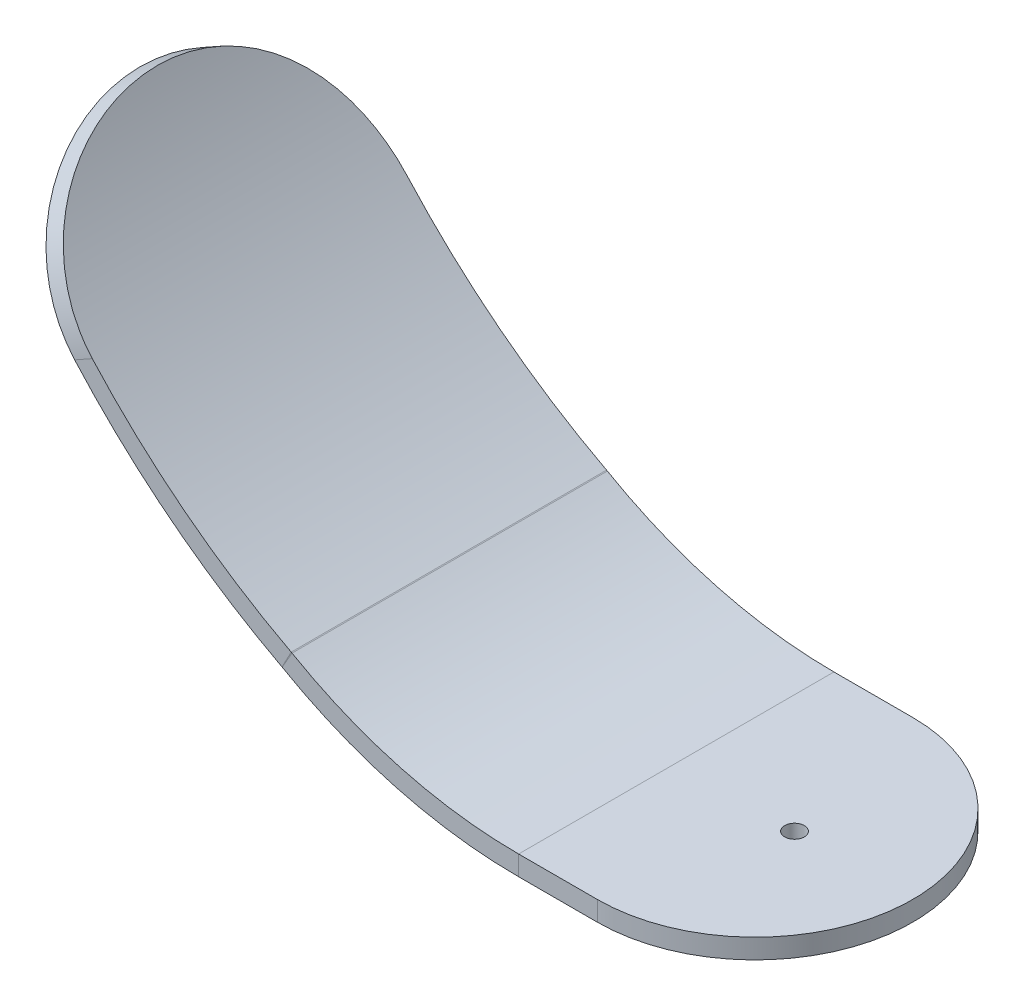
ISO-10303-21;
HEADER;
FILE_DESCRIPTION(('STEP AP214'),'2;1');
FILE_NAME('part.step','',(''),(''),'','','');
FILE_SCHEMA(('AUTOMOTIVE_DESIGN { 1 0 10303 214 1 1 1 1 }'));
ENDSEC;
DATA;
#1=APPLICATION_CONTEXT('core data for automotive mechanical design processes');
#2=APPLICATION_PROTOCOL_DEFINITION('international standard','automotive_design',2000,#1);
#3=PRODUCT_CONTEXT('',#1,'mechanical');
#4=PRODUCT('Part','Part','',(#3));
#5=PRODUCT_RELATED_PRODUCT_CATEGORY('part','',(#4));
#6=PRODUCT_DEFINITION_FORMATION('','',#4);
#7=PRODUCT_DEFINITION_CONTEXT('part definition',#1,'design');
#8=PRODUCT_DEFINITION('design','',#6,#7);
#9=PRODUCT_DEFINITION_SHAPE('','',#8);
#10=(LENGTH_UNIT() NAMED_UNIT(*) SI_UNIT(.MILLI.,.METRE.));
#11=(NAMED_UNIT(*) PLANE_ANGLE_UNIT() SI_UNIT($,.RADIAN.));
#12=(NAMED_UNIT(*) SI_UNIT($,.STERADIAN.) SOLID_ANGLE_UNIT());
#13=UNCERTAINTY_MEASURE_WITH_UNIT(LENGTH_MEASURE(1.E-05),#10,'distance_accuracy_value','');
#14=(GEOMETRIC_REPRESENTATION_CONTEXT(3) GLOBAL_UNCERTAINTY_ASSIGNED_CONTEXT((#13)) GLOBAL_UNIT_ASSIGNED_CONTEXT((#10,
#11,#12)) REPRESENTATION_CONTEXT('',''));
#15=CARTESIAN_POINT('',(0.,0.,0.));
#16=DIRECTION('',(0.,0.,1.));
#17=DIRECTION('',(1.,0.,0.));
#18=AXIS2_PLACEMENT_3D('',#15,#16,#17);
#19=CARTESIAN_POINT('',(-25.4,0.,25.4));
#20=DIRECTION('',(0.,-1.,0.));
#21=DIRECTION('',(1.,0.,0.));
#22=AXIS2_PLACEMENT_3D('',#19,#20,#21);
#23=CYLINDRICAL_SURFACE('',#22,25.4);
#24=DIRECTION('',(0.,-1.,0.));
#25=VECTOR('',#24,1.);
#26=CARTESIAN_POINT('',(-25.4,115.402982206025,50.8));
#27=LINE('',#26,#25);
#28=CARTESIAN_POINT('',(-25.4,0.,50.8));
#29=VERTEX_POINT('',#28);
#30=CARTESIAN_POINT('',(-25.4,3.175,50.8));
#31=VERTEX_POINT('',#30);
#32=EDGE_CURVE('E263',#29,#31,#27,.F.);
#33=ORIENTED_EDGE('',*,*,#32,.F.);
#34=CARTESIAN_POINT('',(-25.4,0.,25.4));
#35=DIRECTION('',(0.,-1.,0.));
#36=DIRECTION('',(1.,0.,0.));
#37=AXIS2_PLACEMENT_3D('',#34,#35,#36);
#38=CIRCLE('',#37,25.4);
#39=CARTESIAN_POINT('',(-25.4,0.,0.));
#40=VERTEX_POINT('',#39);
#41=EDGE_CURVE('E47',#40,#29,#38,.T.);
#42=ORIENTED_EDGE('',*,*,#41,.F.);
#43=DIRECTION('',(0.,-1.,0.));
#44=VECTOR('',#43,1.);
#45=CARTESIAN_POINT('',(-25.4,13.0250291489278,0.));
#46=LINE('',#45,#44);
#47=CARTESIAN_POINT('',(-25.4,3.175,0.));
#48=VERTEX_POINT('',#47);
#49=EDGE_CURVE('E266',#48,#40,#46,.T.);
#50=ORIENTED_EDGE('',*,*,#49,.F.);
#51=CARTESIAN_POINT('',(-25.4,3.175,25.4));
#52=DIRECTION('',(0.,-1.,0.));
#53=DIRECTION('',(1.,0.,0.));
#54=AXIS2_PLACEMENT_3D('',#51,#52,#53);
#55=CIRCLE('',#54,25.4);
#56=EDGE_CURVE('E11',#31,#48,#55,.F.);
#57=ORIENTED_EDGE('',*,*,#56,.F.);
#58=EDGE_LOOP('',(#33,#42,#50,#57));
#59=FACE_BOUND('',#58,.T.);
#60=ADVANCED_FACE('F39',(#59),#23,.T.);
#61=CARTESIAN_POINT('',(-106.784722598422,37.9480346007612,25.4));
#62=DIRECTION('',(0.87169546734506,0.490047969294923,0.));
#63=DIRECTION('',(-0.490047969294923,0.87169546734506,0.));
#64=AXIS2_PLACEMENT_3D('',#61,#62,#63);
#65=CYLINDRICAL_SURFACE('',#64,25.4000000000003);
#66=DIRECTION('',(0.87169546734506,0.490047969294923,0.));
#67=VECTOR('',#66,1.);
#68=CARTESIAN_POINT('',(-93.0073183432006,45.6933874566041,50.8));
#69=LINE('',#68,#67);
#70=CARTESIAN_POINT('',(-106.784722598422,37.9480346007612,50.8));
#71=VERTEX_POINT('',#70);
#72=CARTESIAN_POINT('',(-109.619648197066,36.3543019443849,50.8));
#73=VERTEX_POINT('',#72);
#74=EDGE_CURVE('E146',#71,#73,#69,.F.);
#75=ORIENTED_EDGE('',*,*,#74,.F.);
#76=CARTESIAN_POINT('',(-106.784722598422,37.9480346007612,0.));
#77=CARTESIAN_POINT('',(-107.023325601551,38.2127882243219,3.30865011441573E-07));
#78=CARTESIAN_POINT('',(-107.260675530576,38.4786182917818,0.00714117887424488));
#79=CARTESIAN_POINT('',(-107.732536388339,39.0120287740208,0.0357754976010913));
#80=CARTESIAN_POINT('',(-107.967047256145,39.2796092261776,0.0572692758084516));
#81=CARTESIAN_POINT('',(-108.665750928703,40.0842909912057,0.143380062575102));
#82=CARTESIAN_POINT('',(-109.125172099691,40.6233963054945,0.229626489559083));
#83=CARTESIAN_POINT('',(-110.02788218582,41.7023744570321,0.459814883355029));
#84=CARTESIAN_POINT('',(-110.471176556576,42.2422469692981,0.60373713697935));
#85=CARTESIAN_POINT('',(-111.339119219691,43.3186572998939,0.948841399319553));
#86=CARTESIAN_POINT('',(-111.763768644082,43.8551953189753,1.15001992614539));
#87=CARTESIAN_POINT('',(-112.592506415038,44.9210974957197,1.60897857426348));
#88=CARTESIAN_POINT('',(-112.996568009149,45.4504516949598,1.86683013836865));
#89=CARTESIAN_POINT('',(-113.781424373004,46.4966616478754,2.4375084979489));
#90=CARTESIAN_POINT('',(-114.162218499472,47.0135170557581,2.75033681244138));
#91=CARTESIAN_POINT('',(-114.898537515845,48.0297945282585,3.42879298796404));
#92=CARTESIAN_POINT('',(-115.254074733404,48.5292250363796,3.79439482284478));
#93=CARTESIAN_POINT('',(-115.938615586909,49.50631996806,4.57602489001189));
#94=CARTESIAN_POINT('',(-116.26761967713,49.9839847642107,4.99205225865415));
#95=CARTESIAN_POINT('',(-116.894019674781,50.9072982058846,5.86611413775237));
#96=CARTESIAN_POINT('',(-117.191759072911,51.3532722424196,6.32355901334728));
#97=CARTESIAN_POINT('',(-117.759447388803,52.2155825876365,7.28158744410139));
#98=CARTESIAN_POINT('',(-118.029396384675,52.631918979621,7.78217087800213));
#99=CARTESIAN_POINT('',(-118.5410600844,53.4313098109132,8.82320649495364));
#100=CARTESIAN_POINT('',(-118.782761666191,53.8143487612183,9.363677018466));
#101=CARTESIAN_POINT('',(-119.237430279372,54.5433895512321,10.4804831304676));
#102=CARTESIAN_POINT('',(-119.450397473687,54.8893916009396,11.0568185155742));
#103=CARTESIAN_POINT('',(-119.84848873594,55.5429298181129,12.2445422003344));
#104=CARTESIAN_POINT('',(-120.033455172619,55.8502466847024,12.8561040004677));
#105=CARTESIAN_POINT('',(-120.374088607986,56.4213318392348,14.1071285531171));
#106=CARTESIAN_POINT('',(-120.529754041975,56.6850978014307,14.7465927934019));
#107=CARTESIAN_POINT('',(-120.811652624602,57.166348540325,16.048271908731));
#108=CARTESIAN_POINT('',(-120.937912999544,57.3838761129752,16.7104650817196));
#109=CARTESIAN_POINT('',(-121.161229981467,57.7708748190289,18.0534636162973));
#110=CARTESIAN_POINT('',(-121.258292401379,57.9403555175503,18.7342652437055));
#111=CARTESIAN_POINT('',(-121.399430699345,58.187830218272,19.9106795545831));
#112=CARTESIAN_POINT('',(-121.450712120316,58.2781069823503,20.4028963558551));
#113=CARTESIAN_POINT('',(-121.538613225629,58.4331996769902,21.3927169764286));
#114=CARTESIAN_POINT('',(-121.575230918439,58.4980121491337,21.8903215180391));
#115=CARTESIAN_POINT('',(-121.633810382664,58.6018365529991,22.8890896378454));
#116=CARTESIAN_POINT('',(-121.655771655947,58.640847607799,23.3902533364224));
#117=CARTESIAN_POINT('',(-121.685049220584,58.6928802693916,24.3942604051255));
#118=CARTESIAN_POINT('',(-121.692367476007,58.7059053616795,24.8971035409246));
#119=CARTESIAN_POINT('',(-121.692366061648,58.7058979633249,26.1133183594673));
#120=CARTESIAN_POINT('',(-121.677640346954,58.6796820895864,26.826744000839));
#121=CARTESIAN_POINT('',(-121.618711507486,58.5750523055059,28.2486227830917));
#122=CARTESIAN_POINT('',(-121.574502307595,58.4966276374653,28.9570748687556));
#123=CARTESIAN_POINT('',(-121.456500422935,58.2882463230997,30.3645067201338));
#124=CARTESIAN_POINT('',(-121.382682359954,58.158245471078,31.0634778268719));
#125=CARTESIAN_POINT('',(-121.205395131838,57.8479798639155,32.4462988861666));
#126=CARTESIAN_POINT('',(-121.101927499142,57.6677177065452,33.1301496182531));
#127=CARTESIAN_POINT('',(-120.865299668034,57.2587283113785,34.4777051307567));
#128=CARTESIAN_POINT('',(-120.732148289986,57.0300154714419,35.1414158292538));
#129=CARTESIAN_POINT('',(-120.436080523831,56.5262866765252,36.444181079214));
#130=CARTESIAN_POINT('',(-120.273163748624,56.2512701193676,37.0832353098882));
#131=CARTESIAN_POINT('',(-119.917595171532,55.6576125458774,38.3320169658976));
#132=CARTESIAN_POINT('',(-119.724947907837,55.338978188389,38.941748848521));
#133=CARTESIAN_POINT('',(-119.309996272135,54.6610910418912,40.1276154322085));
#134=CARTESIAN_POINT('',(-119.087692084198,54.3018385049853,40.7037503417642));
#135=CARTESIAN_POINT('',(-118.61412275359,53.5468675173285,41.8171884689482));
#136=CARTESIAN_POINT('',(-118.362915211663,53.1512218986343,42.3545655629029));
#137=CARTESIAN_POINT('',(-117.831601654033,52.326600751898,43.3878710279075));
#138=CARTESIAN_POINT('',(-117.551495566226,51.8976251406978,43.8837992955363));
#139=CARTESIAN_POINT('',(-116.963059661177,51.0104271164967,44.8305971984173));
#140=CARTESIAN_POINT('',(-116.65473292408,50.5522078969411,45.2814717398536));
#141=CARTESIAN_POINT('',(-116.0107475153,49.6107726167076,46.1350119629347));
#142=CARTESIAN_POINT('',(-115.675089407283,49.1275570716126,46.5376786383643));
#143=CARTESIAN_POINT('',(-114.980523857103,48.1446585225039,47.2889092967448));
#144=CARTESIAN_POINT('',(-114.621830032719,47.6451433854686,47.637890512962));
#145=CARTESIAN_POINT('',(-113.880241122737,46.6303857118902,48.2834050863107));
#146=CARTESIAN_POINT('',(-113.497344940675,46.1151424633481,48.5799360649206));
#147=CARTESIAN_POINT('',(-112.70926278618,45.0735638299626,49.1186701265746));
#148=CARTESIAN_POINT('',(-112.304079516041,44.5472297946231,49.360879778042));
#149=CARTESIAN_POINT('',(-111.473572918818,43.4879585973653,49.7896631798453));
#150=CARTESIAN_POINT('',(-111.048253698924,42.9550227982637,49.976248219928));
#151=CARTESIAN_POINT('',(-110.309589264829,42.0463945082449,50.2457281786717));
#152=CARTESIAN_POINT('',(-110.000711405726,41.6712446559402,50.3429497392153));
#153=CARTESIAN_POINT('',(-109.375200146736,40.9213068757451,50.509522928987));
#154=CARTESIAN_POINT('',(-109.058568145678,40.5465188950705,50.5788795462586));
#155=CARTESIAN_POINT('',(-108.419025463186,39.7992839563848,50.689621993426));
#156=CARTESIAN_POINT('',(-108.096126147414,39.4268341345264,50.7310543305587));
#157=CARTESIAN_POINT('',(-107.444516259768,38.6848848763692,50.7862538113699));
#158=CARTESIAN_POINT('',(-107.115804877149,38.3153858622927,50.800017064183));
#159=CARTESIAN_POINT('',(-106.784722598422,37.9480346007613,50.8000000000003));
#160=B_SPLINE_CURVE_WITH_KNOTS('',3,(#76,#77,#78,#79,#80,#81,#82,#83,#84,#85,#86,#87,#88,#89,
#90,#91,#92,#93,#94,#95,#96,#97,#98,#99,#100,#101,#102,#103,#104,#105,#106,#107,#108,#109,#110,
#111,#112,#113,#114,#115,#116,#117,#118,#119,#120,#121,#122,#123,#124,#125,#126,#127,#128,#129,
#130,#131,#132,#133,#134,#135,#136,#137,#138,#139,#140,#141,#142,#143,#144,#145,#146,#147,#148,
#149,#150,#151,#152,#153,#154,#155,#156,#157,#158,#159),.UNSPECIFIED.,.F.,.F.,(4,2,2,2,2,2,2,2,
2,2,2,2,2,2,2,2,2,2,2,2,2,2,2,2,2,2,2,2,2,2,2,2,2,2,2,2,2,2,2,2,2,4),(0.,1.06906494698775,
2.13815279780436,4.2760725035595,6.41326210593933,8.55032176850064,10.6900910493909,
12.8299194617857,14.9686961645655,17.1074362414376,19.2194607875017,21.3314793970558,
23.4444752570183,25.5574591356887,27.6819279911379,29.8065102628412,31.9291174812651,
34.0513018362107,35.5596226716561,37.0681482880631,38.5767251726269,40.0850996982768,
42.2246081849275,44.3645576569483,46.5063452454546,48.6480221555533,50.7890635242088,
52.9301327391432,55.070875454815,57.2116048843368,59.3481396846592,61.4846798158009,
63.6209870314932,65.7572502005211,67.8759660324053,69.9947779195228,72.113333465957,
74.2314587304616,75.7174027563744,77.2030806680041,78.6862780625312,80.1696840117706),.UNSPECIFIED.);
#161=CARTESIAN_POINT('',(-106.784722598422,37.9480346007612,0.));
#162=VERTEX_POINT('',#161);
#163=EDGE_CURVE('E211',#162,#71,#160,.T.);
#164=ORIENTED_EDGE('',*,*,#163,.F.);
#165=DIRECTION('',(-0.87169546734506,-0.490047969294923,0.));
#166=VECTOR('',#165,1.);
#167=CARTESIAN_POINT('',(-106.784722598422,37.9480346007612,0.));
#168=LINE('',#167,#166);
#169=CARTESIAN_POINT('',(-109.619648197066,36.3543019443849,0.));
#170=VERTEX_POINT('',#169);
#171=EDGE_CURVE('E208',#170,#162,#168,.F.);
#172=ORIENTED_EDGE('',*,*,#171,.F.);
#173=CARTESIAN_POINT('',(-109.619648197066,36.3543019443849,50.8));
#174=CARTESIAN_POINT('',(-109.856684647917,36.6205153726169,50.7999996691407));
#175=CARTESIAN_POINT('',(-110.092494087076,36.8877684792837,50.7928380754912));
#176=CARTESIAN_POINT('',(-110.561327225008,37.4239487970942,50.7641254129413));
#177=CARTESIAN_POINT('',(-110.794350867339,37.692876041989,50.7425740530024));
#178=CARTESIAN_POINT('',(-111.48867223753,38.501476202545,50.6562426571512));
#179=CARTESIAN_POINT('',(-111.945280948255,39.0430355524584,50.5697853386797));
#180=CARTESIAN_POINT('',(-112.842594159045,40.1265838125329,50.3390861433986));
#181=CARTESIAN_POINT('',(-113.283304337101,40.6685724972526,50.1948651235117));
#182=CARTESIAN_POINT('',(-114.146328525858,41.7488916295281,49.8491069199071));
#183=CARTESIAN_POINT('',(-114.56864360809,42.2872222886212,49.6475730798761));
#184=CARTESIAN_POINT('',(-115.392951103006,43.3563766146426,49.1878841304094));
#185=CARTESIAN_POINT('',(-115.794917933489,43.887190255688,48.9296598225549));
#186=CARTESIAN_POINT('',(-116.575848686518,44.9360251238294,48.3582335520248));
#187=CARTESIAN_POINT('',(-116.954811993085,45.4540460081458,48.0450301180119));
#188=CARTESIAN_POINT('',(-117.687736860527,46.4723930283072,47.3658316346703));
#189=CARTESIAN_POINT('',(-118.041710293389,46.9727275092857,46.9998619079746));
#190=CARTESIAN_POINT('',(-118.72337484245,47.9513918040916,46.217515886895));
#191=CARTESIAN_POINT('',(-119.051066392835,48.4297219813833,45.8011404255197));
#192=CARTESIAN_POINT('',(-119.675292639808,49.3544499919483,44.9261277693685));
#193=CARTESIAN_POINT('',(-119.972150490264,49.8011590203259,44.4680497564059));
#194=CARTESIAN_POINT('',(-120.538245995256,50.6647234797638,43.5087262951302));
#195=CARTESIAN_POINT('',(-120.8074837156,51.0815789819529,43.0074809496735));
#196=CARTESIAN_POINT('',(-121.317866686622,51.8818110043325,41.9651016526541));
#197=CARTESIAN_POINT('',(-121.558998990148,52.2651720746426,41.4239495034085));
#198=CARTESIAN_POINT('',(-122.01264296502,52.9946805698633,40.3057663189756));
#199=CARTESIAN_POINT('',(-122.225154811875,53.3408282229741,39.7287355038379));
#200=CARTESIAN_POINT('',(-122.622368428721,53.9944196640047,38.5397566199285));
#201=CARTESIAN_POINT('',(-122.806920131854,54.3016532432744,37.9276428655535));
#202=CARTESIAN_POINT('',(-123.14679346357,54.8724508035747,36.6755295085244));
#203=CARTESIAN_POINT('',(-123.302113519534,55.1360124350304,36.0355284078539));
#204=CARTESIAN_POINT('',(-123.58336223321,55.6167489427627,34.7328034938892));
#205=CARTESIAN_POINT('',(-123.709318308018,55.8339670736699,34.0701015449581));
#206=CARTESIAN_POINT('',(-123.93204451221,56.2202592129703,32.7261159969562));
#207=CARTESIAN_POINT('',(-124.028820514354,56.3893429084813,32.0448361669935));
#208=CARTESIAN_POINT('',(-124.169228195288,56.6356556032368,30.8696401087896));
#209=CARTESIAN_POINT('',(-124.220125929756,56.7252882422794,30.3791382510331));
#210=CARTESIAN_POINT('',(-124.307373329242,56.8792696844455,29.3928062051459));
#211=CARTESIAN_POINT('',(-124.34372105105,56.9436151103465,28.896975314377));
#212=CARTESIAN_POINT('',(-124.4018672161,57.0466841396899,27.9018451848182));
#213=CARTESIAN_POINT('',(-124.423666687349,57.0854095534913,27.4025461936108));
#214=CARTESIAN_POINT('',(-124.452733935091,57.1370699874016,26.4021826860786));
#215=CARTESIAN_POINT('',(-124.460000608451,57.150003049705,25.9011180386208));
#216=CARTESIAN_POINT('',(-124.459999133882,57.14999565881,24.6866694098299));
#217=CARTESIAN_POINT('',(-124.445272646507,57.1237790018005,23.9732306336741));
#218=CARTESIAN_POINT('',(-124.386343846258,57.0191441635877,22.55132504788));
#219=CARTESIAN_POINT('',(-124.342135405224,56.9407151294526,21.8428593028881));
#220=CARTESIAN_POINT('',(-124.224145879068,56.7323153156231,20.4353953050146));
#221=CARTESIAN_POINT('',(-124.150339204502,56.6022999374814,19.7364057869001));
#222=CARTESIAN_POINT('',(-123.97310145946,56.2919867857572,18.3535493228887));
#223=CARTESIAN_POINT('',(-123.869671934092,56.1116916347486,17.6696815902526));
#224=CARTESIAN_POINT('',(-123.633169068041,55.7026070769076,16.3220974978328));
#225=CARTESIAN_POINT('',(-123.500104722366,55.4738323860118,15.6583750926843));
#226=CARTESIAN_POINT('',(-123.204285313838,54.9699350497098,14.3555868199373));
#227=CARTESIAN_POINT('',(-123.041529862391,54.6948117977048,13.7165212751763));
#228=CARTESIAN_POINT('',(-122.686388221924,54.1008792187893,12.4677183628427));
#229=CARTESIAN_POINT('',(-122.494006650694,53.78207670097,11.857976444033));
#230=CARTESIAN_POINT('',(-122.079721855982,53.1037704255811,10.6720870261377));
#231=CARTESIAN_POINT('',(-121.857818812851,52.7442669166629,10.0959393218503));
#232=CARTESIAN_POINT('',(-121.385193148976,51.9886483434294,8.9824110273131));
#233=CARTESIAN_POINT('',(-121.134524694935,51.5926023574062,8.44496057727446));
#234=CARTESIAN_POINT('',(-120.604480687118,50.7670425951542,7.41150957726689));
#235=CARTESIAN_POINT('',(-120.325105058743,50.3375287319566,6.91550913501593));
#236=CARTESIAN_POINT('',(-119.738346192798,49.4490855143951,5.96856228444157));
#237=CARTESIAN_POINT('',(-119.430965733446,48.9901590792409,5.5176114162619));
#238=CARTESIAN_POINT('',(-118.78911447152,48.0471166407457,4.66392005562827));
#239=CARTESIAN_POINT('',(-118.454644219532,47.5630011494311,4.26117858375459));
#240=CARTESIAN_POINT('',(-117.762550199406,46.577873781998,3.50963906296199));
#241=CARTESIAN_POINT('',(-117.405126718158,46.0770225828801,3.16044586689158));
#242=CARTESIAN_POINT('',(-116.666322471476,45.0593369513628,2.51456738523274));
#243=CARTESIAN_POINT('',(-116.284940601445,44.5425017825835,2.21788452303622));
#244=CARTESIAN_POINT('',(-115.500143276246,43.4974757455859,1.67892676796323));
#245=CARTESIAN_POINT('',(-115.096730844263,42.9692864414618,1.43664443308165));
#246=CARTESIAN_POINT('',(-114.270017181863,41.9060221146853,1.00781045174917));
#247=CARTESIAN_POINT('',(-113.846720044972,41.3709485255782,0.821247392444506));
#248=CARTESIAN_POINT('',(-113.112738378635,40.4597212632424,0.552285066263908));
#249=CARTESIAN_POINT('',(-112.806487466623,40.0841866492688,0.455434090584687));
#250=CARTESIAN_POINT('',(-112.186398274675,39.3333342265346,0.289480817779988));
#251=CARTESIAN_POINT('',(-111.872561378298,38.9580163908329,0.220373500550059));
#252=CARTESIAN_POINT('',(-111.238756368639,38.2095633680984,0.110018310806868));
#253=CARTESIAN_POINT('',(-110.918799303701,37.8364255913487,0.0687243600345234));
#254=CARTESIAN_POINT('',(-110.273213844784,37.092937491274,0.0137047792041568));
#255=CARTESIAN_POINT('',(-109.947584635907,36.7225875796025,-1.68561260407032E-05));
#256=CARTESIAN_POINT('',(-109.619648197066,36.3543019443849,-3.22031762151008E-13));
#257=B_SPLINE_CURVE_WITH_KNOTS('',3,(#173,#174,#175,#176,#177,#178,#179,#180,#181,#182,#183,
#184,#185,#186,#187,#188,#189,#190,#191,#192,#193,#194,#195,#196,#197,#198,#199,#200,#201,#202,
#203,#204,#205,#206,#207,#208,#209,#210,#211,#212,#213,#214,#215,#216,#217,#218,#219,#220,#221,
#222,#223,#224,#225,#226,#227,#228,#229,#230,#231,#232,#233,#234,#235,#236,#237,#238,#239,#240,
#241,#242,#243,#244,#245,#246,#247,#248,#249,#250,#251,#252,#253,#254,#255,#256),.UNSPECIFIED.,
.F.,.F.,(4,2,2,2,2,2,2,2,2,2,2,2,2,2,2,2,2,2,2,2,2,2,2,2,2,2,2,2,2,2,2,2,2,2,2,2,2,2,2,2,2,4),
(0.,1.06919065125569,2.13840292795149,4.27655518016874,6.41393609796215,8.55119234440878,
10.6910720528244,12.8310090368801,14.9699224587796,17.1088005376711,19.2223365306501,
21.3358674877705,23.4503682562509,25.5648560574396,27.6903186363122,29.8158955291351,
31.9394797541279,34.0626363024083,35.565469260701,37.0685028610339,38.5714302427942,
40.0744717020655,42.2140184127416,44.3540099912674,46.4958557230943,48.6375897579532,
50.7786745995611,52.9197874653506,55.0605669354304,57.2013333277227,59.3381327283815,
61.4749376818625,63.6115308840255,65.748080671896,67.8680150654028,69.9880472700005,
72.1077892767483,74.227096803273,75.7088078161505,77.19025059835,78.6692330052552,
80.1484296744091),.UNSPECIFIED.);
#258=EDGE_CURVE('E218',#73,#170,#257,.T.);
#259=ORIENTED_EDGE('',*,*,#258,.F.);
#260=EDGE_LOOP('',(#75,#164,#172,#259));
#261=FACE_BOUND('',#260,.T.);
#262=ADVANCED_FACE('F226',(#261),#65,.T.);
#263=CARTESIAN_POINT('',(-38.1,3.175,50.8));
#264=DIRECTION('',(0.,0.,1.));
#265=DIRECTION('',(1.,0.,0.));
#266=AXIS2_PLACEMENT_3D('',#263,#264,#265);
#267=PLANE('',#266);
#268=DIRECTION('',(0.,-1.,0.));
#269=VECTOR('',#268,1.);
#270=CARTESIAN_POINT('',(-38.1,3.175,50.8));
#271=LINE('',#270,#269);
#272=CARTESIAN_POINT('',(-38.1,3.175,50.8));
#273=VERTEX_POINT('',#272);
#274=CARTESIAN_POINT('',(-38.1,0.,50.8));
#275=VERTEX_POINT('',#274);
#276=EDGE_CURVE('E204',#273,#275,#271,.T.);
#277=ORIENTED_EDGE('',*,*,#276,.F.);
#278=CARTESIAN_POINT('',(-38.1,76.2,50.8));
#279=DIRECTION('',(0.,0.,1.));
#280=DIRECTION('',(1.,0.,0.));
#281=AXIS2_PLACEMENT_3D('',#278,#279,#280);
#282=CIRCLE('',#281,73.025);
#283=CARTESIAN_POINT('',(-74.6006325917478,12.9516447217619,50.8));
#284=VERTEX_POINT('',#283);
#285=EDGE_CURVE('E161',#273,#284,#282,.F.);
#286=ORIENTED_EDGE('',*,*,#285,.T.);
#287=DIRECTION('',(-0.499837488418323,-0.86611920956163,0.));
#288=VECTOR('',#287,1.);
#289=CARTESIAN_POINT('',(-74.6006325917478,12.9516447217619,50.8));
#290=LINE('',#289,#288);
#291=CARTESIAN_POINT('',(-76.187616617476,10.2017162314037,50.8));
#292=VERTEX_POINT('',#291);
#293=EDGE_CURVE('E126',#284,#292,#290,.T.);
#294=ORIENTED_EDGE('',*,*,#293,.T.);
#295=CARTESIAN_POINT('',(-38.1,76.2,50.8));
#296=DIRECTION('',(0.,0.,-1.));
#297=DIRECTION('',(-1.,0.,0.));
#298=AXIS2_PLACEMENT_3D('',#295,#296,#297);
#299=CIRCLE('',#298,76.2);
#300=EDGE_CURVE('E152',#275,#292,#299,.T.);
#301=ORIENTED_EDGE('',*,*,#300,.F.);
#302=EDGE_LOOP('',(#277,#286,#294,#301));
#303=FACE_BOUND('',#302,.T.);
#304=ADVANCED_FACE('F250',(#303),#267,.T.);
#305=CARTESIAN_POINT('',(-38.1,0.,0.));
#306=DIRECTION('',(0.,0.,-1.));
#307=DIRECTION('',(-1.,0.,0.));
#308=AXIS2_PLACEMENT_3D('',#305,#306,#307);
#309=PLANE('',#308);
#310=DIRECTION('',(0.,1.,0.));
#311=VECTOR('',#310,1.);
#312=CARTESIAN_POINT('',(-38.1,0.,0.));
#313=LINE('',#312,#311);
#314=CARTESIAN_POINT('',(-38.1,0.,0.));
#315=VERTEX_POINT('',#314);
#316=CARTESIAN_POINT('',(-38.1,3.175,0.));
#317=VERTEX_POINT('',#316);
#318=EDGE_CURVE('E125',#315,#317,#313,.T.);
#319=ORIENTED_EDGE('',*,*,#318,.F.);
#320=CARTESIAN_POINT('',(-38.1,76.2,0.));
#321=DIRECTION('',(0.,0.,-1.));
#322=DIRECTION('',(-1.,0.,0.));
#323=AXIS2_PLACEMENT_3D('',#320,#321,#322);
#324=CIRCLE('',#323,76.2);
#325=CARTESIAN_POINT('',(-76.187616617476,10.2017162314037,0.));
#326=VERTEX_POINT('',#325);
#327=EDGE_CURVE('E173',#315,#326,#324,.T.);
#328=ORIENTED_EDGE('',*,*,#327,.T.);
#329=DIRECTION('',(0.499837488418323,0.86611920956163,0.));
#330=VECTOR('',#329,1.);
#331=CARTESIAN_POINT('',(-76.187616617476,10.2017162314037,0.));
#332=LINE('',#331,#330);
#333=CARTESIAN_POINT('',(-74.6006325917478,12.9516447217619,0.));
#334=VERTEX_POINT('',#333);
#335=EDGE_CURVE('E199',#326,#334,#332,.T.);
#336=ORIENTED_EDGE('',*,*,#335,.T.);
#337=CARTESIAN_POINT('',(-38.1,76.2,0.));
#338=DIRECTION('',(0.,0.,1.));
#339=DIRECTION('',(1.,0.,0.));
#340=AXIS2_PLACEMENT_3D('',#337,#338,#339);
#341=CIRCLE('',#340,73.025);
#342=EDGE_CURVE('E180',#317,#334,#341,.F.);
#343=ORIENTED_EDGE('',*,*,#342,.F.);
#344=EDGE_LOOP('',(#319,#328,#336,#343));
#345=FACE_BOUND('',#344,.T.);
#346=ADVANCED_FACE('F248',(#345),#309,.T.);
#347=CARTESIAN_POINT('',(-76.2126745001761,10.2155353767791,50.8));
#348=DIRECTION('',(0.,0.,1.));
#349=DIRECTION('',(1.,0.,0.));
#350=AXIS2_PLACEMENT_3D('',#347,#348,#349);
#351=PLANE('',#350);
#352=DIRECTION('',(0.465819184453999,0.884879928235809,0.));
#353=VECTOR('',#352,1.);
#354=CARTESIAN_POINT('',(-76.2126745001761,10.2155353767791,50.8));
#355=LINE('',#354,#353);
#356=CARTESIAN_POINT('',(-76.2126745001761,10.2155353767791,50.8));
#357=VERTEX_POINT('',#356);
#358=CARTESIAN_POINT('',(-74.7336985895347,13.0250291489278,50.8));
#359=VERTEX_POINT('',#358);
#360=EDGE_CURVE('E113',#357,#359,#355,.T.);
#361=ORIENTED_EDGE('',*,*,#360,.F.);
#362=CARTESIAN_POINT('',(-76.555796911445,9.56373282164059,50.8));
#363=DIRECTION('',(0.,0.,-1.));
#364=DIRECTION('',(-1.,0.,0.));
#365=AXIS2_PLACEMENT_3D('',#362,#363,#364);
#366=CIRCLE('',#365,0.7366);
#367=EDGE_CURVE('E117',#292,#357,#366,.F.);
#368=ORIENTED_EDGE('',*,*,#367,.F.);
#369=ORIENTED_EDGE('',*,*,#293,.F.);
#370=CARTESIAN_POINT('',(-76.555796911445,9.56373282164059,50.8));
#371=DIRECTION('',(0.,0.,1.));
#372=DIRECTION('',(1.,0.,0.));
#373=AXIS2_PLACEMENT_3D('',#370,#371,#372);
#374=CIRCLE('',#373,3.9116);
#375=EDGE_CURVE('E120',#284,#359,#374,.T.);
#376=ORIENTED_EDGE('',*,*,#375,.T.);
#377=EDGE_LOOP('',(#361,#368,#369,#376));
#378=FACE_BOUND('',#377,.T.);
#379=ADVANCED_FACE('F115',(#378),#351,.T.);
#380=CARTESIAN_POINT('',(-74.6006325917478,12.9516447217619,50.8));
#381=DIRECTION('',(0.,0.,1.));
#382=DIRECTION('',(1.,0.,0.));
#383=AXIS2_PLACEMENT_3D('',#380,#381,#382);
#384=PLANE('',#383);
#385=CARTESIAN_POINT('',(-20.8398164057572,115.402982206025,50.8));
#386=DIRECTION('',(0.,0.,1.));
#387=DIRECTION('',(1.,0.,0.));
#388=AXIS2_PLACEMENT_3D('',#385,#386,#387);
#389=CIRCLE('',#388,115.697);
#390=EDGE_CURVE('E147',#359,#71,#389,.F.);
#391=ORIENTED_EDGE('',*,*,#390,.T.);
#392=ORIENTED_EDGE('',*,*,#74,.T.);
#393=CARTESIAN_POINT('',(-20.8398164057572,115.402982206025,50.8));
#394=DIRECTION('',(0.,0.,-1.));
#395=DIRECTION('',(-1.,0.,0.));
#396=AXIS2_PLACEMENT_3D('',#393,#394,#395);
#397=CIRCLE('',#396,118.872);
#398=EDGE_CURVE('E134',#357,#73,#397,.T.);
#399=ORIENTED_EDGE('',*,*,#398,.F.);
#400=ORIENTED_EDGE('',*,*,#360,.T.);
#401=EDGE_LOOP('',(#391,#392,#399,#400));
#402=FACE_BOUND('',#401,.T.);
#403=ADVANCED_FACE('F144',(#402),#384,.T.);
#404=CARTESIAN_POINT('',(-76.187616617476,10.2017162314037,0.));
#405=DIRECTION('',(0.,0.,-1.));
#406=DIRECTION('',(-1.,0.,0.));
#407=AXIS2_PLACEMENT_3D('',#404,#405,#406);
#408=PLANE('',#407);
#409=ORIENTED_EDGE('',*,*,#335,.F.);
#410=CARTESIAN_POINT('',(-76.555796911445,9.56373282164059,0.));
#411=DIRECTION('',(0.,0.,-1.));
#412=DIRECTION('',(-1.,0.,0.));
#413=AXIS2_PLACEMENT_3D('',#410,#411,#412);
#414=CIRCLE('',#413,0.7366);
#415=CARTESIAN_POINT('',(-76.2126745001761,10.2155353767791,0.));
#416=VERTEX_POINT('',#415);
#417=EDGE_CURVE('E171',#326,#416,#414,.F.);
#418=ORIENTED_EDGE('',*,*,#417,.T.);
#419=DIRECTION('',(-0.465819184453999,-0.884879928235809,0.));
#420=VECTOR('',#419,1.);
#421=CARTESIAN_POINT('',(-74.7336985895347,13.0250291489278,0.));
#422=LINE('',#421,#420);
#423=CARTESIAN_POINT('',(-74.7336985895347,13.0250291489278,0.));
#424=VERTEX_POINT('',#423);
#425=EDGE_CURVE('E140',#424,#416,#422,.T.);
#426=ORIENTED_EDGE('',*,*,#425,.F.);
#427=CARTESIAN_POINT('',(-76.555796911445,9.56373282164059,0.));
#428=DIRECTION('',(0.,0.,1.));
#429=DIRECTION('',(1.,0.,0.));
#430=AXIS2_PLACEMENT_3D('',#427,#428,#429);
#431=CIRCLE('',#430,3.9116);
#432=EDGE_CURVE('E183',#334,#424,#431,.T.);
#433=ORIENTED_EDGE('',*,*,#432,.F.);
#434=EDGE_LOOP('',(#409,#418,#426,#433));
#435=FACE_BOUND('',#434,.T.);
#436=ADVANCED_FACE('F239',(#435),#408,.T.);
#437=CARTESIAN_POINT('',(-74.7336985895347,13.0250291489278,0.));
#438=DIRECTION('',(0.,0.,-1.));
#439=DIRECTION('',(-1.,0.,0.));
#440=AXIS2_PLACEMENT_3D('',#437,#438,#439);
#441=PLANE('',#440);
#442=DIRECTION('',(-1.,0.,0.));
#443=VECTOR('',#442,1.);
#444=CARTESIAN_POINT('',(0.,3.175,0.));
#445=LINE('',#444,#443);
#446=EDGE_CURVE('E178',#48,#317,#445,.T.);
#447=ORIENTED_EDGE('',*,*,#446,.F.);
#448=ORIENTED_EDGE('',*,*,#49,.T.);
#449=DIRECTION('',(-1.,0.,0.));
#450=VECTOR('',#449,1.);
#451=CARTESIAN_POINT('',(0.,0.,0.));
#452=LINE('',#451,#450);
#453=EDGE_CURVE('E176',#40,#315,#452,.T.);
#454=ORIENTED_EDGE('',*,*,#453,.T.);
#455=ORIENTED_EDGE('',*,*,#318,.T.);
#456=EDGE_LOOP('',(#447,#448,#454,#455));
#457=FACE_BOUND('',#456,.T.);
#458=ADVANCED_FACE('F233',(#457),#441,.T.);
#459=CARTESIAN_POINT('',(-20.8398164057572,115.402982206025,50.8));
#460=DIRECTION('',(0.,0.,-1.));
#461=DIRECTION('',(-1.,0.,0.));
#462=AXIS2_PLACEMENT_3D('',#459,#460,#461);
#463=CYLINDRICAL_SURFACE('',#462,115.697);
#464=CARTESIAN_POINT('',(-20.8398164057572,115.402982206025,0.));
#465=DIRECTION('',(0.,0.,1.));
#466=DIRECTION('',(1.,0.,0.));
#467=AXIS2_PLACEMENT_3D('',#464,#465,#466);
#468=CIRCLE('',#467,115.697);
#469=EDGE_CURVE('E166',#424,#162,#468,.F.);
#470=ORIENTED_EDGE('',*,*,#469,.T.);
#471=ORIENTED_EDGE('',*,*,#163,.T.);
#472=ORIENTED_EDGE('',*,*,#390,.F.);
#473=DIRECTION('',(0.,0.,-1.));
#474=VECTOR('',#473,1.);
#475=CARTESIAN_POINT('',(-74.7336985895347,13.0250291489278,50.8));
#476=LINE('',#475,#474);
#477=EDGE_CURVE('E165',#359,#424,#476,.T.);
#478=ORIENTED_EDGE('',*,*,#477,.T.);
#479=EDGE_LOOP('',(#470,#471,#472,#478));
#480=FACE_BOUND('',#479,.T.);
#481=ADVANCED_FACE('F229',(#480),#463,.F.);
#482=CARTESIAN_POINT('',(-20.8398164057572,115.402982206025,50.8));
#483=DIRECTION('',(0.,0.,-1.));
#484=DIRECTION('',(-1.,0.,0.));
#485=AXIS2_PLACEMENT_3D('',#482,#483,#484);
#486=CYLINDRICAL_SURFACE('',#485,118.872);
#487=ORIENTED_EDGE('',*,*,#398,.T.);
#488=ORIENTED_EDGE('',*,*,#258,.T.);
#489=CARTESIAN_POINT('',(-20.8398164057572,115.402982206025,0.));
#490=DIRECTION('',(0.,0.,-1.));
#491=DIRECTION('',(-1.,0.,0.));
#492=AXIS2_PLACEMENT_3D('',#489,#490,#491);
#493=CIRCLE('',#492,118.872);
#494=EDGE_CURVE('E136',#416,#170,#493,.T.);
#495=ORIENTED_EDGE('',*,*,#494,.F.);
#496=DIRECTION('',(0.,0.,-1.));
#497=VECTOR('',#496,1.);
#498=CARTESIAN_POINT('',(-76.2126745001761,10.2155353767791,50.8));
#499=LINE('',#498,#497);
#500=EDGE_CURVE('E132',#357,#416,#499,.T.);
#501=ORIENTED_EDGE('',*,*,#500,.F.);
#502=EDGE_LOOP('',(#487,#488,#495,#501));
#503=FACE_BOUND('',#502,.T.);
#504=ADVANCED_FACE('F133',(#503),#486,.T.);
#505=CARTESIAN_POINT('',(-76.555796911445,9.56373282164059,50.8));
#506=DIRECTION('',(0.,0.,-1.));
#507=DIRECTION('',(-1.,0.,0.));
#508=AXIS2_PLACEMENT_3D('',#505,#506,#507);
#509=CYLINDRICAL_SURFACE('',#508,0.7366);
#510=ORIENTED_EDGE('',*,*,#417,.F.);
#511=DIRECTION('',(0.,0.,-1.));
#512=VECTOR('',#511,1.);
#513=CARTESIAN_POINT('',(-76.187616617476,10.2017162314037,50.8));
#514=LINE('',#513,#512);
#515=EDGE_CURVE('E141',#292,#326,#514,.T.);
#516=ORIENTED_EDGE('',*,*,#515,.F.);
#517=ORIENTED_EDGE('',*,*,#367,.T.);
#518=ORIENTED_EDGE('',*,*,#500,.T.);
#519=EDGE_LOOP('',(#510,#516,#517,#518));
#520=FACE_BOUND('',#519,.T.);
#521=ADVANCED_FACE('F150',(#520),#509,.F.);
#522=CARTESIAN_POINT('',(-38.1,76.2,50.8));
#523=DIRECTION('',(0.,0.,-1.));
#524=DIRECTION('',(-1.,0.,0.));
#525=AXIS2_PLACEMENT_3D('',#522,#523,#524);
#526=CYLINDRICAL_SURFACE('',#525,76.2);
#527=ORIENTED_EDGE('',*,*,#327,.F.);
#528=DIRECTION('',(0.,0.,-1.));
#529=VECTOR('',#528,1.);
#530=CARTESIAN_POINT('',(-38.1,0.,50.8));
#531=LINE('',#530,#529);
#532=EDGE_CURVE('E194',#275,#315,#531,.T.);
#533=ORIENTED_EDGE('',*,*,#532,.F.);
#534=ORIENTED_EDGE('',*,*,#300,.T.);
#535=ORIENTED_EDGE('',*,*,#515,.T.);
#536=EDGE_LOOP('',(#527,#533,#534,#535));
#537=FACE_BOUND('',#536,.T.);
#538=ADVANCED_FACE('F285',(#537),#526,.T.);
#539=CARTESIAN_POINT('',(0.,0.,50.8));
#540=DIRECTION('',(0.,-1.,0.));
#541=DIRECTION('',(1.,0.,0.));
#542=AXIS2_PLACEMENT_3D('',#539,#540,#541);
#543=PLANE('',#542);
#544=CARTESIAN_POINT('',(-19.05,0.,25.4));
#545=DIRECTION('',(0.,1.,0.));
#546=DIRECTION('',(-1.,0.,0.));
#547=AXIS2_PLACEMENT_3D('',#544,#545,#546);
#548=CIRCLE('',#547,1.5875);
#549=CARTESIAN_POINT('',(-20.6375,0.,25.4));
#550=VERTEX_POINT('',#549);
#551=EDGE_CURVE('E169',#550,#550,#548,.T.);
#552=ORIENTED_EDGE('',*,*,#551,.T.);
#553=EDGE_LOOP('',(#552));
#554=FACE_BOUND('',#553,.T.);
#555=ORIENTED_EDGE('',*,*,#453,.F.);
#556=ORIENTED_EDGE('',*,*,#41,.T.);
#557=DIRECTION('',(-1.,0.,0.));
#558=VECTOR('',#557,1.);
#559=CARTESIAN_POINT('',(0.,0.,50.8));
#560=LINE('',#559,#558);
#561=EDGE_CURVE('E154',#29,#275,#560,.T.);
#562=ORIENTED_EDGE('',*,*,#561,.T.);
#563=ORIENTED_EDGE('',*,*,#532,.T.);
#564=EDGE_LOOP('',(#555,#556,#562,#563));
#565=FACE_BOUND('',#564,.T.);
#566=ADVANCED_FACE('F271',(#554,#565),#543,.T.);
#567=CARTESIAN_POINT('',(0.,3.175,50.8));
#568=DIRECTION('',(0.,-1.,0.));
#569=DIRECTION('',(1.,0.,0.));
#570=AXIS2_PLACEMENT_3D('',#567,#568,#569);
#571=PLANE('',#570);
#572=CARTESIAN_POINT('',(-19.05,3.175,25.4));
#573=DIRECTION('',(0.,1.,0.));
#574=DIRECTION('',(-1.,0.,0.));
#575=AXIS2_PLACEMENT_3D('',#572,#573,#574);
#576=CIRCLE('',#575,1.5875);
#577=CARTESIAN_POINT('',(-20.6375,3.175,25.4));
#578=VERTEX_POINT('',#577);
#579=EDGE_CURVE('E295',#578,#578,#576,.T.);
#580=ORIENTED_EDGE('',*,*,#579,.F.);
#581=EDGE_LOOP('',(#580));
#582=FACE_BOUND('',#581,.T.);
#583=DIRECTION('',(-1.,0.,0.));
#584=VECTOR('',#583,1.);
#585=CARTESIAN_POINT('',(0.,3.175,50.8));
#586=LINE('',#585,#584);
#587=EDGE_CURVE('E159',#31,#273,#586,.T.);
#588=ORIENTED_EDGE('',*,*,#587,.F.);
#589=ORIENTED_EDGE('',*,*,#56,.T.);
#590=ORIENTED_EDGE('',*,*,#446,.T.);
#591=DIRECTION('',(0.,0.,-1.));
#592=VECTOR('',#591,1.);
#593=CARTESIAN_POINT('',(-38.1,3.175,50.8));
#594=LINE('',#593,#592);
#595=EDGE_CURVE('E191',#273,#317,#594,.T.);
#596=ORIENTED_EDGE('',*,*,#595,.F.);
#597=EDGE_LOOP('',(#588,#589,#590,#596));
#598=FACE_BOUND('',#597,.T.);
#599=ADVANCED_FACE('F277',(#582,#598),#571,.F.);
#600=CARTESIAN_POINT('',(-38.1,76.2,50.8));
#601=DIRECTION('',(0.,0.,-1.));
#602=DIRECTION('',(-1.,0.,0.));
#603=AXIS2_PLACEMENT_3D('',#600,#601,#602);
#604=CYLINDRICAL_SURFACE('',#603,73.025);
#605=ORIENTED_EDGE('',*,*,#342,.T.);
#606=DIRECTION('',(0.,0.,-1.));
#607=VECTOR('',#606,1.);
#608=CARTESIAN_POINT('',(-74.6006325917478,12.9516447217619,50.8));
#609=LINE('',#608,#607);
#610=EDGE_CURVE('E188',#284,#334,#609,.T.);
#611=ORIENTED_EDGE('',*,*,#610,.F.);
#612=ORIENTED_EDGE('',*,*,#285,.F.);
#613=ORIENTED_EDGE('',*,*,#595,.T.);
#614=EDGE_LOOP('',(#605,#611,#612,#613));
#615=FACE_BOUND('',#614,.T.);
#616=ADVANCED_FACE('F282',(#615),#604,.F.);
#617=CARTESIAN_POINT('',(-76.555796911445,9.56373282164059,50.8));
#618=DIRECTION('',(0.,0.,-1.));
#619=DIRECTION('',(-1.,0.,0.));
#620=AXIS2_PLACEMENT_3D('',#617,#618,#619);
#621=CYLINDRICAL_SURFACE('',#620,3.9116);
#622=ORIENTED_EDGE('',*,*,#432,.T.);
#623=ORIENTED_EDGE('',*,*,#477,.F.);
#624=ORIENTED_EDGE('',*,*,#375,.F.);
#625=ORIENTED_EDGE('',*,*,#610,.T.);
#626=EDGE_LOOP('',(#622,#623,#624,#625));
#627=FACE_BOUND('',#626,.T.);
#628=ADVANCED_FACE('F288',(#627),#621,.T.);
#629=CARTESIAN_POINT('',(-20.8398164057572,115.402982206025,50.8));
#630=DIRECTION('',(0.,0.,1.));
#631=DIRECTION('',(1.,0.,0.));
#632=AXIS2_PLACEMENT_3D('',#629,#630,#631);
#633=PLANE('',#632);
#634=ORIENTED_EDGE('',*,*,#561,.F.);
#635=ORIENTED_EDGE('',*,*,#32,.T.);
#636=ORIENTED_EDGE('',*,*,#587,.T.);
#637=ORIENTED_EDGE('',*,*,#276,.T.);
#638=EDGE_LOOP('',(#634,#635,#636,#637));
#639=FACE_BOUND('',#638,.T.);
#640=ADVANCED_FACE('F267',(#639),#633,.T.);
#641=CARTESIAN_POINT('',(-20.8398164057572,115.402982206025,0.));
#642=DIRECTION('',(0.,0.,1.));
#643=DIRECTION('',(1.,0.,0.));
#644=AXIS2_PLACEMENT_3D('',#641,#642,#643);
#645=PLANE('',#644);
#646=ORIENTED_EDGE('',*,*,#494,.T.);
#647=ORIENTED_EDGE('',*,*,#171,.T.);
#648=ORIENTED_EDGE('',*,*,#469,.F.);
#649=ORIENTED_EDGE('',*,*,#425,.T.);
#650=EDGE_LOOP('',(#646,#647,#648,#649));
#651=FACE_BOUND('',#650,.T.);
#652=ADVANCED_FACE('F291',(#651),#645,.F.);
#653=CARTESIAN_POINT('',(-19.05,0.,25.4));
#654=DIRECTION('',(0.,1.,0.));
#655=DIRECTION('',(-1.,0.,0.));
#656=AXIS2_PLACEMENT_3D('',#653,#654,#655);
#657=CYLINDRICAL_SURFACE('',#656,1.5875);
#658=ORIENTED_EDGE('',*,*,#551,.F.);
#659=EDGE_LOOP('',(#658));
#660=FACE_BOUND('',#659,.T.);
#661=ORIENTED_EDGE('',*,*,#579,.T.);
#662=EDGE_LOOP('',(#661));
#663=FACE_BOUND('',#662,.T.);
#664=ADVANCED_FACE('F302',(#660,#663),#657,.F.);
#665=CLOSED_SHELL('',(#60,#262,#304,#346,#379,#403,#436,#458,#481,#504,#521,#538,#566,#599,#616,
#628,#640,#652,#664));
#666=MANIFOLD_SOLID_BREP('B2',#665);
#667=ADVANCED_BREP_SHAPE_REPRESENTATION('',(#18,#666),#14);
#668=SHAPE_DEFINITION_REPRESENTATION(#9,#667);
ENDSEC;
END-ISO-10303-21;
